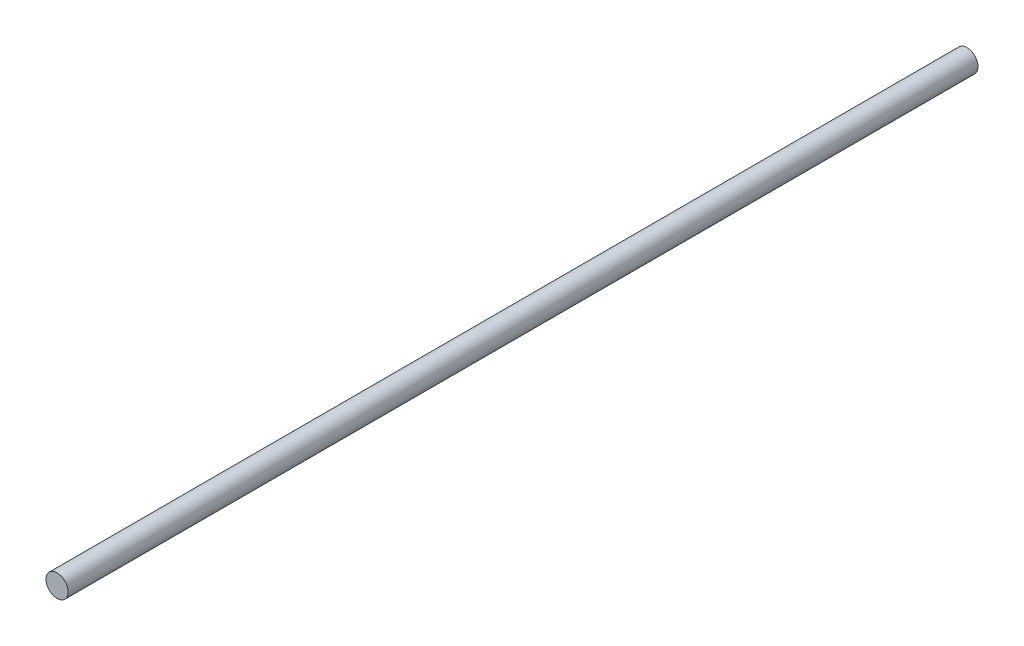
ISO-10303-21;
HEADER;
FILE_DESCRIPTION(('STEP AP214'),'2;1');
FILE_NAME('part.step','',(''),(''),'','','');
FILE_SCHEMA(('AUTOMOTIVE_DESIGN { 1 0 10303 214 1 1 1 1 }'));
ENDSEC;
DATA;
#1=APPLICATION_CONTEXT('core data for automotive mechanical design processes');
#2=APPLICATION_PROTOCOL_DEFINITION('international standard','automotive_design',2000,#1);
#3=PRODUCT_CONTEXT('',#1,'mechanical');
#4=PRODUCT('Part','Part','',(#3));
#5=PRODUCT_RELATED_PRODUCT_CATEGORY('part','',(#4));
#6=PRODUCT_DEFINITION_FORMATION('','',#4);
#7=PRODUCT_DEFINITION_CONTEXT('part definition',#1,'design');
#8=PRODUCT_DEFINITION('design','',#6,#7);
#9=PRODUCT_DEFINITION_SHAPE('','',#8);
#10=(LENGTH_UNIT() NAMED_UNIT(*) SI_UNIT(.MILLI.,.METRE.));
#11=(NAMED_UNIT(*) PLANE_ANGLE_UNIT() SI_UNIT($,.RADIAN.));
#12=(NAMED_UNIT(*) SI_UNIT($,.STERADIAN.) SOLID_ANGLE_UNIT());
#13=UNCERTAINTY_MEASURE_WITH_UNIT(LENGTH_MEASURE(1.E-05),#10,'distance_accuracy_value','');
#14=(GEOMETRIC_REPRESENTATION_CONTEXT(3) GLOBAL_UNCERTAINTY_ASSIGNED_CONTEXT((#13)) GLOBAL_UNIT_ASSIGNED_CONTEXT((#10,
#11,#12)) REPRESENTATION_CONTEXT('',''));
#15=CARTESIAN_POINT('',(0.,0.,0.));
#16=DIRECTION('',(0.,0.,1.));
#17=DIRECTION('',(1.,0.,0.));
#18=AXIS2_PLACEMENT_3D('',#15,#16,#17);
#19=CARTESIAN_POINT('',(0.,0.,-123.));
#20=DIRECTION('',(0.,0.,1.));
#21=DIRECTION('',(1.,0.,0.));
#22=AXIS2_PLACEMENT_3D('',#19,#20,#21);
#23=CYLINDRICAL_SURFACE('',#22,3.);
#24=CARTESIAN_POINT('',(0.,0.,-123.));
#25=DIRECTION('',(0.,0.,1.));
#26=DIRECTION('',(1.,0.,0.));
#27=AXIS2_PLACEMENT_3D('',#24,#25,#26);
#28=CIRCLE('',#27,3.);
#29=CARTESIAN_POINT('',(3.,0.,-123.));
#30=VERTEX_POINT('',#29);
#31=EDGE_CURVE('E10',#30,#30,#28,.T.);
#32=ORIENTED_EDGE('',*,*,#31,.T.);
#33=EDGE_LOOP('',(#32));
#34=FACE_BOUND('',#33,.T.);
#35=CARTESIAN_POINT('',(0.,0.,123.));
#36=DIRECTION('',(0.,0.,1.));
#37=DIRECTION('',(1.,0.,0.));
#38=AXIS2_PLACEMENT_3D('',#35,#36,#37);
#39=CIRCLE('',#38,3.);
#40=CARTESIAN_POINT('',(3.,0.,123.));
#41=VERTEX_POINT('',#40);
#42=EDGE_CURVE('E35',#41,#41,#39,.T.);
#43=ORIENTED_EDGE('',*,*,#42,.F.);
#44=EDGE_LOOP('',(#43));
#45=FACE_BOUND('',#44,.T.);
#46=ADVANCED_FACE('F29',(#34,#45),#23,.T.);
#47=CARTESIAN_POINT('',(0.,0.,-123.));
#48=DIRECTION('',(0.,0.,1.));
#49=DIRECTION('',(1.,0.,0.));
#50=AXIS2_PLACEMENT_3D('',#47,#48,#49);
#51=PLANE('',#50);
#52=ORIENTED_EDGE('',*,*,#31,.F.);
#53=EDGE_LOOP('',(#52));
#54=FACE_BOUND('',#53,.T.);
#55=ADVANCED_FACE('F44',(#54),#51,.F.);
#56=CARTESIAN_POINT('',(0.,0.,123.));
#57=DIRECTION('',(0.,0.,1.));
#58=DIRECTION('',(1.,0.,0.));
#59=AXIS2_PLACEMENT_3D('',#56,#57,#58);
#60=PLANE('',#59);
#61=ORIENTED_EDGE('',*,*,#42,.T.);
#62=EDGE_LOOP('',(#61));
#63=FACE_BOUND('',#62,.T.);
#64=ADVANCED_FACE('F41',(#63),#60,.T.);
#65=CLOSED_SHELL('',(#46,#55,#64));
#66=MANIFOLD_SOLID_BREP('B2',#65);
#67=ADVANCED_BREP_SHAPE_REPRESENTATION('',(#18,#66),#14);
#68=SHAPE_DEFINITION_REPRESENTATION(#9,#67);
ENDSEC;
END-ISO-10303-21;
